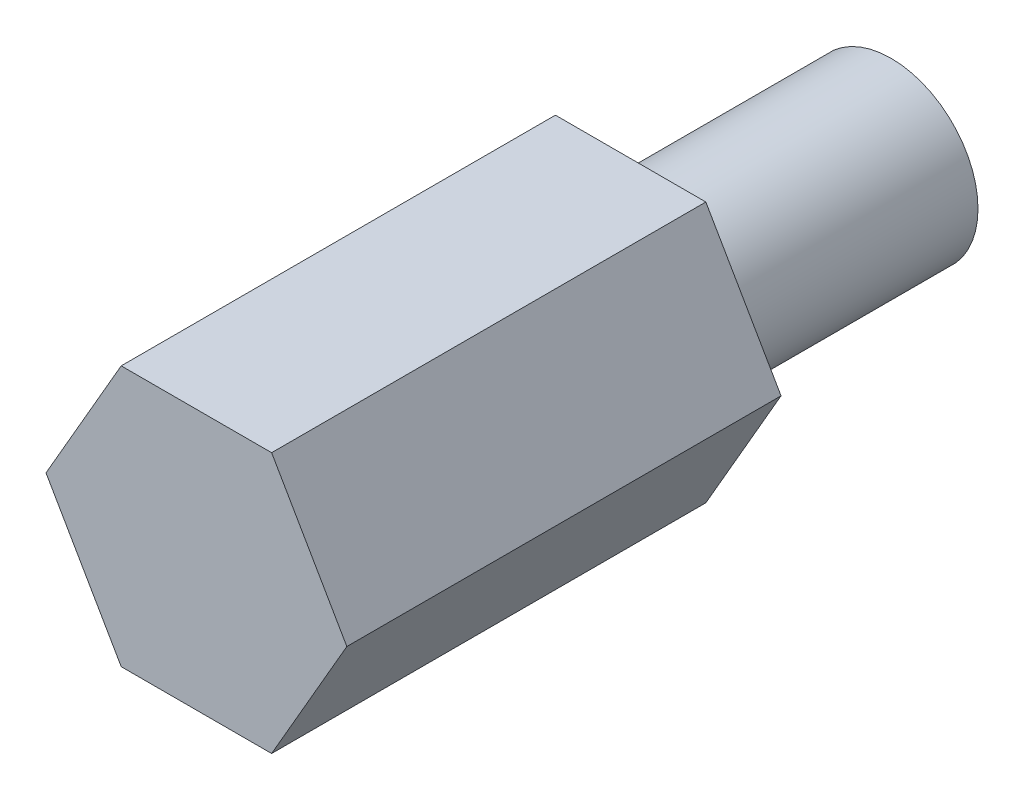
ISO-10303-21;
HEADER;
FILE_DESCRIPTION(('STEP AP214'),'2;1');
FILE_NAME('part.step','',(''),(''),'','','');
FILE_SCHEMA(('AUTOMOTIVE_DESIGN { 1 0 10303 214 1 1 1 1 }'));
ENDSEC;
DATA;
#1=APPLICATION_CONTEXT('core data for automotive mechanical design processes');
#2=APPLICATION_PROTOCOL_DEFINITION('international standard','automotive_design',2000,#1);
#3=PRODUCT_CONTEXT('',#1,'mechanical');
#4=PRODUCT('Part','Part','',(#3));
#5=PRODUCT_RELATED_PRODUCT_CATEGORY('part','',(#4));
#6=PRODUCT_DEFINITION_FORMATION('','',#4);
#7=PRODUCT_DEFINITION_CONTEXT('part definition',#1,'design');
#8=PRODUCT_DEFINITION('design','',#6,#7);
#9=PRODUCT_DEFINITION_SHAPE('','',#8);
#10=(LENGTH_UNIT() NAMED_UNIT(*) SI_UNIT(.MILLI.,.METRE.));
#11=(NAMED_UNIT(*) PLANE_ANGLE_UNIT() SI_UNIT($,.RADIAN.));
#12=(NAMED_UNIT(*) SI_UNIT($,.STERADIAN.) SOLID_ANGLE_UNIT());
#13=UNCERTAINTY_MEASURE_WITH_UNIT(LENGTH_MEASURE(1.E-05),#10,'distance_accuracy_value','');
#14=(GEOMETRIC_REPRESENTATION_CONTEXT(3) GLOBAL_UNCERTAINTY_ASSIGNED_CONTEXT((#13)) GLOBAL_UNIT_ASSIGNED_CONTEXT((#10,
#11,#12)) REPRESENTATION_CONTEXT('',''));
#15=CARTESIAN_POINT('',(0.,0.,0.));
#16=DIRECTION('',(0.,0.,1.));
#17=DIRECTION('',(1.,0.,0.));
#18=AXIS2_PLACEMENT_3D('',#15,#16,#17);
#19=CARTESIAN_POINT('',(0.866025403784453,-1.49999999999998,5.));
#20=DIRECTION('',(-0.866025403784441,0.499999999999995,0.));
#21=DIRECTION('',(-0.499999999999995,-0.866025403784441,0.));
#22=AXIS2_PLACEMENT_3D('',#19,#20,#21);
#23=PLANE('',#22);
#24=DIRECTION('',(0.499999999999995,0.866025403784441,0.));
#25=VECTOR('',#24,1.);
#26=CARTESIAN_POINT('',(0.866025403784453,-1.49999999999998,0.));
#27=LINE('',#26,#25);
#28=CARTESIAN_POINT('',(0.866025403784453,-1.49999999999998,0.));
#29=VERTEX_POINT('',#28);
#30=CARTESIAN_POINT('',(1.73205080756887,0.,0.));
#31=VERTEX_POINT('',#30);
#32=EDGE_CURVE('E121',#29,#31,#27,.T.);
#33=ORIENTED_EDGE('',*,*,#32,.T.);
#34=DIRECTION('',(0.,0.,-1.));
#35=VECTOR('',#34,1.);
#36=CARTESIAN_POINT('',(1.73205080756887,0.,5.));
#37=LINE('',#36,#35);
#38=CARTESIAN_POINT('',(1.73205080756887,0.,5.));
#39=VERTEX_POINT('',#38);
#40=EDGE_CURVE('E38',#39,#31,#37,.T.);
#41=ORIENTED_EDGE('',*,*,#40,.F.);
#42=DIRECTION('',(0.499999999999995,0.866025403784441,0.));
#43=VECTOR('',#42,1.);
#44=CARTESIAN_POINT('',(0.866025403784453,-1.49999999999998,5.));
#45=LINE('',#44,#43);
#46=CARTESIAN_POINT('',(0.866025403784453,-1.49999999999998,5.));
#47=VERTEX_POINT('',#46);
#48=EDGE_CURVE('E132',#47,#39,#45,.T.);
#49=ORIENTED_EDGE('',*,*,#48,.F.);
#50=DIRECTION('',(0.,0.,-1.));
#51=VECTOR('',#50,1.);
#52=CARTESIAN_POINT('',(0.866025403784453,-1.49999999999998,5.));
#53=LINE('',#52,#51);
#54=EDGE_CURVE('E117',#47,#29,#53,.T.);
#55=ORIENTED_EDGE('',*,*,#54,.T.);
#56=EDGE_LOOP('',(#33,#41,#49,#55));
#57=FACE_BOUND('',#56,.T.);
#58=ADVANCED_FACE('F35',(#57),#23,.F.);
#59=CARTESIAN_POINT('',(1.73205080756887,0.,5.));
#60=DIRECTION('',(-0.866025403784438,-0.500000000000001,0.));
#61=DIRECTION('',(0.500000000000001,-0.866025403784438,0.));
#62=AXIS2_PLACEMENT_3D('',#59,#60,#61);
#63=PLANE('',#62);
#64=DIRECTION('',(-0.500000000000001,0.866025403784438,0.));
#65=VECTOR('',#64,1.);
#66=CARTESIAN_POINT('',(1.73205080756887,0.,0.));
#67=LINE('',#66,#65);
#68=CARTESIAN_POINT('',(0.866025403784432,1.5,0.));
#69=VERTEX_POINT('',#68);
#70=EDGE_CURVE('E124',#31,#69,#67,.T.);
#71=ORIENTED_EDGE('',*,*,#70,.T.);
#72=DIRECTION('',(0.,0.,-1.));
#73=VECTOR('',#72,1.);
#74=CARTESIAN_POINT('',(0.866025403784432,1.5,5.));
#75=LINE('',#74,#73);
#76=CARTESIAN_POINT('',(0.866025403784432,1.5,5.));
#77=VERTEX_POINT('',#76);
#78=EDGE_CURVE('E135',#77,#69,#75,.T.);
#79=ORIENTED_EDGE('',*,*,#78,.F.);
#80=DIRECTION('',(-0.500000000000001,0.866025403784438,0.));
#81=VECTOR('',#80,1.);
#82=CARTESIAN_POINT('',(1.73205080756887,0.,5.));
#83=LINE('',#82,#81);
#84=EDGE_CURVE('E90',#39,#77,#83,.T.);
#85=ORIENTED_EDGE('',*,*,#84,.F.);
#86=ORIENTED_EDGE('',*,*,#40,.T.);
#87=EDGE_LOOP('',(#71,#79,#85,#86));
#88=FACE_BOUND('',#87,.T.);
#89=ADVANCED_FACE('F140',(#88),#63,.F.);
#90=CARTESIAN_POINT('',(0.866025403784432,1.5,5.));
#91=DIRECTION('',(0.,-1.,0.));
#92=DIRECTION('',(1.,0.,0.));
#93=AXIS2_PLACEMENT_3D('',#90,#91,#92);
#94=PLANE('',#93);
#95=DIRECTION('',(-1.,0.,0.));
#96=VECTOR('',#95,1.);
#97=CARTESIAN_POINT('',(0.866025403784432,1.5,0.));
#98=LINE('',#97,#96);
#99=CARTESIAN_POINT('',(-0.866025403784442,1.49999999999999,0.));
#100=VERTEX_POINT('',#99);
#101=EDGE_CURVE('E127',#69,#100,#98,.T.);
#102=ORIENTED_EDGE('',*,*,#101,.T.);
#103=DIRECTION('',(0.,0.,-1.));
#104=VECTOR('',#103,1.);
#105=CARTESIAN_POINT('',(-0.866025403784442,1.49999999999999,5.));
#106=LINE('',#105,#104);
#107=CARTESIAN_POINT('',(-0.866025403784442,1.49999999999999,5.));
#108=VERTEX_POINT('',#107);
#109=EDGE_CURVE('E112',#108,#100,#106,.T.);
#110=ORIENTED_EDGE('',*,*,#109,.F.);
#111=DIRECTION('',(-1.,0.,0.));
#112=VECTOR('',#111,1.);
#113=CARTESIAN_POINT('',(0.866025403784432,1.5,5.));
#114=LINE('',#113,#112);
#115=EDGE_CURVE('E103',#77,#108,#114,.T.);
#116=ORIENTED_EDGE('',*,*,#115,.F.);
#117=ORIENTED_EDGE('',*,*,#78,.T.);
#118=EDGE_LOOP('',(#102,#110,#116,#117));
#119=FACE_BOUND('',#118,.T.);
#120=ADVANCED_FACE('F146',(#119),#94,.F.);
#121=CARTESIAN_POINT('',(-0.866025403784442,1.49999999999999,5.));
#122=DIRECTION('',(0.866025403784442,-0.499999999999995,0.));
#123=DIRECTION('',(0.499999999999995,0.866025403784442,0.));
#124=AXIS2_PLACEMENT_3D('',#121,#122,#123);
#125=PLANE('',#124);
#126=DIRECTION('',(-0.499999999999995,-0.866025403784441,0.));
#127=VECTOR('',#126,1.);
#128=CARTESIAN_POINT('',(-0.866025403784442,1.49999999999999,0.));
#129=LINE('',#128,#127);
#130=CARTESIAN_POINT('',(-1.73205080756887,0.,0.));
#131=VERTEX_POINT('',#130);
#132=EDGE_CURVE('E111',#100,#131,#129,.T.);
#133=ORIENTED_EDGE('',*,*,#132,.T.);
#134=DIRECTION('',(0.,0.,-1.));
#135=VECTOR('',#134,1.);
#136=CARTESIAN_POINT('',(-1.73205080756887,0.,5.));
#137=LINE('',#136,#135);
#138=CARTESIAN_POINT('',(-1.73205080756887,0.,5.));
#139=VERTEX_POINT('',#138);
#140=EDGE_CURVE('E108',#139,#131,#137,.T.);
#141=ORIENTED_EDGE('',*,*,#140,.F.);
#142=DIRECTION('',(-0.499999999999995,-0.866025403784441,0.));
#143=VECTOR('',#142,1.);
#144=CARTESIAN_POINT('',(-0.866025403784442,1.49999999999999,5.));
#145=LINE('',#144,#143);
#146=EDGE_CURVE('E97',#108,#139,#145,.T.);
#147=ORIENTED_EDGE('',*,*,#146,.F.);
#148=ORIENTED_EDGE('',*,*,#109,.T.);
#149=EDGE_LOOP('',(#133,#141,#147,#148));
#150=FACE_BOUND('',#149,.T.);
#151=ADVANCED_FACE('F109',(#150),#125,.F.);
#152=CARTESIAN_POINT('',(-1.73205080756887,0.,5.));
#153=DIRECTION('',(0.866025403784434,0.500000000000007,0.));
#154=DIRECTION('',(-0.500000000000007,0.866025403784435,0.));
#155=AXIS2_PLACEMENT_3D('',#152,#153,#154);
#156=PLANE('',#155);
#157=DIRECTION('',(0.500000000000007,-0.866025403784435,0.));
#158=VECTOR('',#157,1.);
#159=CARTESIAN_POINT('',(-1.73205080756887,0.,0.));
#160=LINE('',#159,#158);
#161=CARTESIAN_POINT('',(-0.866025403784422,-1.5,0.));
#162=VERTEX_POINT('',#161);
#163=EDGE_CURVE('E75',#131,#162,#160,.T.);
#164=ORIENTED_EDGE('',*,*,#163,.T.);
#165=DIRECTION('',(0.,0.,-1.));
#166=VECTOR('',#165,1.);
#167=CARTESIAN_POINT('',(-0.866025403784422,-1.5,5.));
#168=LINE('',#167,#166);
#169=CARTESIAN_POINT('',(-0.866025403784422,-1.5,5.));
#170=VERTEX_POINT('',#169);
#171=EDGE_CURVE('E113',#170,#162,#168,.T.);
#172=ORIENTED_EDGE('',*,*,#171,.F.);
#173=DIRECTION('',(0.500000000000007,-0.866025403784435,0.));
#174=VECTOR('',#173,1.);
#175=CARTESIAN_POINT('',(-1.73205080756887,0.,5.));
#176=LINE('',#175,#174);
#177=EDGE_CURVE('E101',#139,#170,#176,.T.);
#178=ORIENTED_EDGE('',*,*,#177,.F.);
#179=ORIENTED_EDGE('',*,*,#140,.T.);
#180=EDGE_LOOP('',(#164,#172,#178,#179));
#181=FACE_BOUND('',#180,.T.);
#182=ADVANCED_FACE('F115',(#181),#156,.F.);
#183=CARTESIAN_POINT('',(-0.866025403784422,-1.5,5.));
#184=DIRECTION('',(0.,1.,0.));
#185=DIRECTION('',(-1.,0.,0.));
#186=AXIS2_PLACEMENT_3D('',#183,#184,#185);
#187=PLANE('',#186);
#188=DIRECTION('',(1.,0.,0.));
#189=VECTOR('',#188,1.);
#190=CARTESIAN_POINT('',(-0.866025403784422,-1.5,0.));
#191=LINE('',#190,#189);
#192=EDGE_CURVE('E81',#162,#29,#191,.T.);
#193=ORIENTED_EDGE('',*,*,#192,.T.);
#194=ORIENTED_EDGE('',*,*,#54,.F.);
#195=DIRECTION('',(1.,0.,0.));
#196=VECTOR('',#195,1.);
#197=CARTESIAN_POINT('',(-0.866025403784422,-1.5,5.));
#198=LINE('',#197,#196);
#199=EDGE_CURVE('E52',#170,#47,#198,.T.);
#200=ORIENTED_EDGE('',*,*,#199,.F.);
#201=ORIENTED_EDGE('',*,*,#171,.T.);
#202=EDGE_LOOP('',(#193,#194,#200,#201));
#203=FACE_BOUND('',#202,.T.);
#204=ADVANCED_FACE('F166',(#203),#187,.F.);
#205=CARTESIAN_POINT('',(0.,0.,5.));
#206=DIRECTION('',(0.,0.,1.));
#207=DIRECTION('',(1.,0.,0.));
#208=AXIS2_PLACEMENT_3D('',#205,#206,#207);
#209=PLANE('',#208);
#210=ORIENTED_EDGE('',*,*,#48,.T.);
#211=ORIENTED_EDGE('',*,*,#84,.T.);
#212=ORIENTED_EDGE('',*,*,#115,.T.);
#213=ORIENTED_EDGE('',*,*,#146,.T.);
#214=ORIENTED_EDGE('',*,*,#177,.T.);
#215=ORIENTED_EDGE('',*,*,#199,.T.);
#216=EDGE_LOOP('',(#210,#211,#212,#213,#214,#215));
#217=FACE_BOUND('',#216,.T.);
#218=ADVANCED_FACE('F99',(#217),#209,.T.);
#219=CARTESIAN_POINT('',(0.,0.,0.));
#220=DIRECTION('',(0.,0.,1.));
#221=DIRECTION('',(1.,0.,0.));
#222=AXIS2_PLACEMENT_3D('',#219,#220,#221);
#223=PLANE('',#222);
#224=CARTESIAN_POINT('',(0.,0.,0.));
#225=DIRECTION('',(0.,0.,-1.));
#226=DIRECTION('',(-1.,0.,0.));
#227=AXIS2_PLACEMENT_3D('',#224,#225,#226);
#228=CIRCLE('',#227,1.);
#229=CARTESIAN_POINT('',(-1.,0.,0.));
#230=VERTEX_POINT('',#229);
#231=EDGE_CURVE('E11',#230,#230,#228,.T.);
#232=ORIENTED_EDGE('',*,*,#231,.F.);
#233=EDGE_LOOP('',(#232));
#234=FACE_BOUND('',#233,.T.);
#235=ORIENTED_EDGE('',*,*,#32,.F.);
#236=ORIENTED_EDGE('',*,*,#192,.F.);
#237=ORIENTED_EDGE('',*,*,#163,.F.);
#238=ORIENTED_EDGE('',*,*,#132,.F.);
#239=ORIENTED_EDGE('',*,*,#101,.F.);
#240=ORIENTED_EDGE('',*,*,#70,.F.);
#241=EDGE_LOOP('',(#235,#236,#237,#238,#239,#240));
#242=FACE_BOUND('',#241,.T.);
#243=ADVANCED_FACE('F145',(#234,#242),#223,.F.);
#244=CARTESIAN_POINT('',(0.,0.,-3.));
#245=DIRECTION('',(0.,0.,1.));
#246=DIRECTION('',(1.,0.,0.));
#247=AXIS2_PLACEMENT_3D('',#244,#245,#246);
#248=CYLINDRICAL_SURFACE('',#247,1.);
#249=CARTESIAN_POINT('',(0.,0.,-3.));
#250=DIRECTION('',(0.,0.,-1.));
#251=DIRECTION('',(-1.,0.,0.));
#252=AXIS2_PLACEMENT_3D('',#249,#250,#251);
#253=CIRCLE('',#252,1.);
#254=CARTESIAN_POINT('',(-1.,0.,-3.));
#255=VERTEX_POINT('',#254);
#256=EDGE_CURVE('E125',#255,#255,#253,.T.);
#257=ORIENTED_EDGE('',*,*,#256,.F.);
#258=EDGE_LOOP('',(#257));
#259=FACE_BOUND('',#258,.T.);
#260=ORIENTED_EDGE('',*,*,#231,.T.);
#261=EDGE_LOOP('',(#260));
#262=FACE_BOUND('',#261,.T.);
#263=ADVANCED_FACE('F155',(#259,#262),#248,.T.);
#264=CARTESIAN_POINT('',(0.,0.,-3.));
#265=DIRECTION('',(0.,0.,-1.));
#266=DIRECTION('',(-1.,0.,0.));
#267=AXIS2_PLACEMENT_3D('',#264,#265,#266);
#268=PLANE('',#267);
#269=ORIENTED_EDGE('',*,*,#256,.T.);
#270=EDGE_LOOP('',(#269));
#271=FACE_BOUND('',#270,.T.);
#272=ADVANCED_FACE('F153',(#271),#268,.T.);
#273=CLOSED_SHELL('',(#58,#89,#120,#151,#182,#204,#218,#243,#263,#272));
#274=MANIFOLD_SOLID_BREP('B2',#273);
#275=ADVANCED_BREP_SHAPE_REPRESENTATION('',(#18,#274),#14);
#276=SHAPE_DEFINITION_REPRESENTATION(#9,#275);
ENDSEC;
END-ISO-10303-21;
